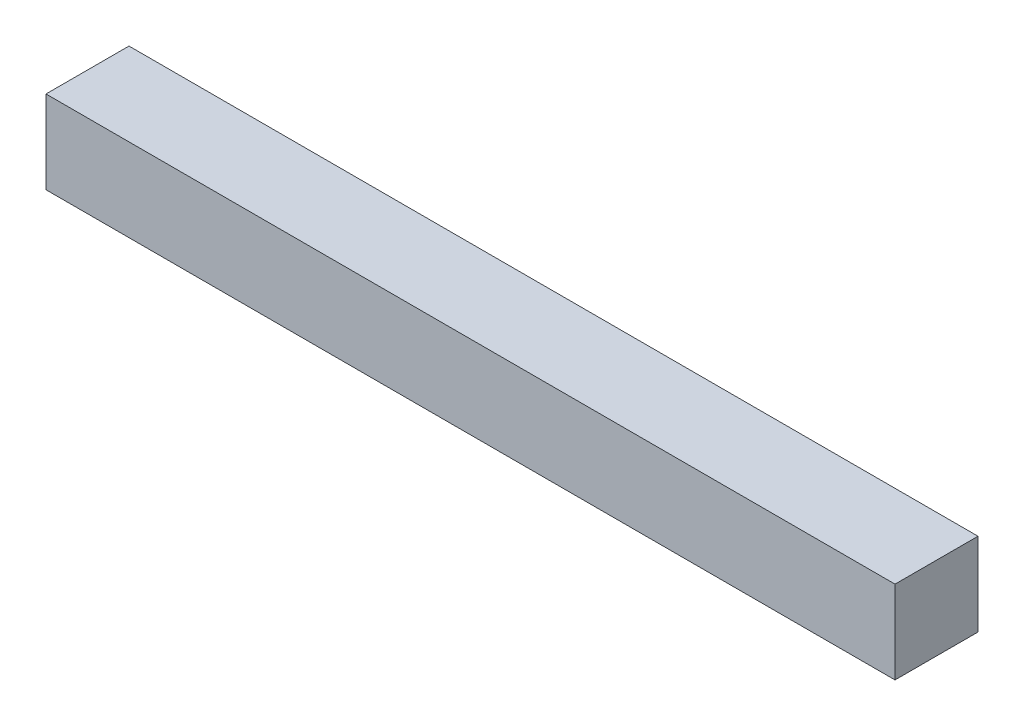
ISO-10303-21;
HEADER;
FILE_DESCRIPTION(('STEP AP214'),'2;1');
FILE_NAME('part.step','',(''),(''),'','','');
FILE_SCHEMA(('AUTOMOTIVE_DESIGN { 1 0 10303 214 1 1 1 1 }'));
ENDSEC;
DATA;
#1=APPLICATION_CONTEXT('core data for automotive mechanical design processes');
#2=APPLICATION_PROTOCOL_DEFINITION('international standard','automotive_design',2000,#1);
#3=PRODUCT_CONTEXT('',#1,'mechanical');
#4=PRODUCT('Part','Part','',(#3));
#5=PRODUCT_RELATED_PRODUCT_CATEGORY('part','',(#4));
#6=PRODUCT_DEFINITION_FORMATION('','',#4);
#7=PRODUCT_DEFINITION_CONTEXT('part definition',#1,'design');
#8=PRODUCT_DEFINITION('design','',#6,#7);
#9=PRODUCT_DEFINITION_SHAPE('','',#8);
#10=(LENGTH_UNIT() NAMED_UNIT(*) SI_UNIT(.MILLI.,.METRE.));
#11=(NAMED_UNIT(*) PLANE_ANGLE_UNIT() SI_UNIT($,.RADIAN.));
#12=(NAMED_UNIT(*) SI_UNIT($,.STERADIAN.) SOLID_ANGLE_UNIT());
#13=UNCERTAINTY_MEASURE_WITH_UNIT(LENGTH_MEASURE(1.E-05),#10,'distance_accuracy_value','');
#14=(GEOMETRIC_REPRESENTATION_CONTEXT(3) GLOBAL_UNCERTAINTY_ASSIGNED_CONTEXT((#13)) GLOBAL_UNIT_ASSIGNED_CONTEXT((#10,
#11,#12)) REPRESENTATION_CONTEXT('',''));
#15=CARTESIAN_POINT('',(0.,0.,0.));
#16=DIRECTION('',(0.,0.,1.));
#17=DIRECTION('',(1.,0.,0.));
#18=AXIS2_PLACEMENT_3D('',#15,#16,#17);
#19=CARTESIAN_POINT('',(-70.6068511796734,40.1724137931035,13.));
#20=DIRECTION('',(1.,0.,0.));
#21=DIRECTION('',(0.,0.,-1.));
#22=AXIS2_PLACEMENT_3D('',#19,#20,#21);
#23=PLANE('',#22);
#24=DIRECTION('',(0.,-1.,0.));
#25=VECTOR('',#24,1.);
#26=CARTESIAN_POINT('',(-70.6068511796734,40.1724137931035,0.));
#27=LINE('',#26,#25);
#28=CARTESIAN_POINT('',(-70.6068511796734,40.1724137931035,0.));
#29=VERTEX_POINT('',#28);
#30=CARTESIAN_POINT('',(-70.6068511796734,27.1724137931035,0.));
#31=VERTEX_POINT('',#30);
#32=EDGE_CURVE('E96',#29,#31,#27,.T.);
#33=ORIENTED_EDGE('',*,*,#32,.T.);
#34=DIRECTION('',(0.,0.,-1.));
#35=VECTOR('',#34,1.);
#36=CARTESIAN_POINT('',(-70.6068511796734,27.1724137931035,13.));
#37=LINE('',#36,#35);
#38=CARTESIAN_POINT('',(-70.6068511796734,27.1724137931035,13.));
#39=VERTEX_POINT('',#38);
#40=EDGE_CURVE('E11',#39,#31,#37,.T.);
#41=ORIENTED_EDGE('',*,*,#40,.F.);
#42=DIRECTION('',(0.,-1.,0.));
#43=VECTOR('',#42,1.);
#44=CARTESIAN_POINT('',(-70.6068511796734,40.1724137931035,13.));
#45=LINE('',#44,#43);
#46=CARTESIAN_POINT('',(-70.6068511796734,40.1724137931035,13.));
#47=VERTEX_POINT('',#46);
#48=EDGE_CURVE('E84',#47,#39,#45,.T.);
#49=ORIENTED_EDGE('',*,*,#48,.F.);
#50=DIRECTION('',(0.,0.,-1.));
#51=VECTOR('',#50,1.);
#52=CARTESIAN_POINT('',(-70.6068511796734,40.1724137931035,13.));
#53=LINE('',#52,#51);
#54=EDGE_CURVE('E92',#47,#29,#53,.T.);
#55=ORIENTED_EDGE('',*,*,#54,.T.);
#56=EDGE_LOOP('',(#33,#41,#49,#55));
#57=FACE_BOUND('',#56,.T.);
#58=ADVANCED_FACE('F33',(#57),#23,.F.);
#59=CARTESIAN_POINT('',(-70.6068511796734,27.1724137931035,13.));
#60=DIRECTION('',(0.,1.,0.));
#61=DIRECTION('',(0.,0.,1.));
#62=AXIS2_PLACEMENT_3D('',#59,#60,#61);
#63=PLANE('',#62);
#64=DIRECTION('',(1.,0.,0.));
#65=VECTOR('',#64,1.);
#66=CARTESIAN_POINT('',(-70.6068511796734,27.1724137931035,0.));
#67=LINE('',#66,#65);
#68=CARTESIAN_POINT('',(62.3931488203266,27.1724137931035,0.));
#69=VERTEX_POINT('',#68);
#70=EDGE_CURVE('E88',#31,#69,#67,.T.);
#71=ORIENTED_EDGE('',*,*,#70,.T.);
#72=DIRECTION('',(0.,0.,-1.));
#73=VECTOR('',#72,1.);
#74=CARTESIAN_POINT('',(62.3931488203266,27.1724137931035,13.));
#75=LINE('',#74,#73);
#76=CARTESIAN_POINT('',(62.3931488203266,27.1724137931035,13.));
#77=VERTEX_POINT('',#76);
#78=EDGE_CURVE('E41',#77,#69,#75,.T.);
#79=ORIENTED_EDGE('',*,*,#78,.F.);
#80=DIRECTION('',(1.,0.,0.));
#81=VECTOR('',#80,1.);
#82=CARTESIAN_POINT('',(-70.6068511796734,27.1724137931035,13.));
#83=LINE('',#82,#81);
#84=EDGE_CURVE('E79',#39,#77,#83,.T.);
#85=ORIENTED_EDGE('',*,*,#84,.F.);
#86=ORIENTED_EDGE('',*,*,#40,.T.);
#87=EDGE_LOOP('',(#71,#79,#85,#86));
#88=FACE_BOUND('',#87,.T.);
#89=ADVANCED_FACE('F87',(#88),#63,.F.);
#90=CARTESIAN_POINT('',(62.3931488203266,40.1724137931035,13.));
#91=DIRECTION('',(-1.,0.,0.));
#92=DIRECTION('',(0.,0.,1.));
#93=AXIS2_PLACEMENT_3D('',#90,#91,#92);
#94=PLANE('',#93);
#95=DIRECTION('',(0.,1.,0.));
#96=VECTOR('',#95,1.);
#97=CARTESIAN_POINT('',(62.3931488203266,40.1724137931035,0.));
#98=LINE('',#97,#96);
#99=CARTESIAN_POINT('',(62.3931488203266,40.1724137931035,0.));
#100=VERTEX_POINT('',#99);
#101=EDGE_CURVE('E66',#69,#100,#98,.T.);
#102=ORIENTED_EDGE('',*,*,#101,.T.);
#103=DIRECTION('',(0.,0.,-1.));
#104=VECTOR('',#103,1.);
#105=CARTESIAN_POINT('',(62.3931488203266,40.1724137931035,13.));
#106=LINE('',#105,#104);
#107=CARTESIAN_POINT('',(62.3931488203266,40.1724137931035,13.));
#108=VERTEX_POINT('',#107);
#109=EDGE_CURVE('E89',#108,#100,#106,.T.);
#110=ORIENTED_EDGE('',*,*,#109,.F.);
#111=DIRECTION('',(0.,1.,0.));
#112=VECTOR('',#111,1.);
#113=CARTESIAN_POINT('',(62.3931488203266,40.1724137931035,13.));
#114=LINE('',#113,#112);
#115=EDGE_CURVE('E82',#77,#108,#114,.T.);
#116=ORIENTED_EDGE('',*,*,#115,.F.);
#117=ORIENTED_EDGE('',*,*,#78,.T.);
#118=EDGE_LOOP('',(#102,#110,#116,#117));
#119=FACE_BOUND('',#118,.T.);
#120=ADVANCED_FACE('F90',(#119),#94,.F.);
#121=CARTESIAN_POINT('',(-70.6068511796734,40.1724137931035,13.));
#122=DIRECTION('',(0.,-1.,0.));
#123=DIRECTION('',(0.,0.,-1.));
#124=AXIS2_PLACEMENT_3D('',#121,#122,#123);
#125=PLANE('',#124);
#126=DIRECTION('',(-1.,0.,0.));
#127=VECTOR('',#126,1.);
#128=CARTESIAN_POINT('',(-70.6068511796734,40.1724137931035,0.));
#129=LINE('',#128,#127);
#130=EDGE_CURVE('E72',#100,#29,#129,.T.);
#131=ORIENTED_EDGE('',*,*,#130,.T.);
#132=ORIENTED_EDGE('',*,*,#54,.F.);
#133=DIRECTION('',(-1.,0.,0.));
#134=VECTOR('',#133,1.);
#135=CARTESIAN_POINT('',(-70.6068511796734,40.1724137931035,13.));
#136=LINE('',#135,#134);
#137=EDGE_CURVE('E49',#108,#47,#136,.T.);
#138=ORIENTED_EDGE('',*,*,#137,.F.);
#139=ORIENTED_EDGE('',*,*,#109,.T.);
#140=EDGE_LOOP('',(#131,#132,#138,#139));
#141=FACE_BOUND('',#140,.T.);
#142=ADVANCED_FACE('F103',(#141),#125,.F.);
#143=CARTESIAN_POINT('',(0.,0.,13.));
#144=DIRECTION('',(0.,0.,1.));
#145=DIRECTION('',(1.,0.,0.));
#146=AXIS2_PLACEMENT_3D('',#143,#144,#145);
#147=PLANE('',#146);
#148=ORIENTED_EDGE('',*,*,#48,.T.);
#149=ORIENTED_EDGE('',*,*,#84,.T.);
#150=ORIENTED_EDGE('',*,*,#115,.T.);
#151=ORIENTED_EDGE('',*,*,#137,.T.);
#152=EDGE_LOOP('',(#148,#149,#150,#151));
#153=FACE_BOUND('',#152,.T.);
#154=ADVANCED_FACE('F80',(#153),#147,.T.);
#155=CARTESIAN_POINT('',(0.,0.,0.));
#156=DIRECTION('',(0.,0.,1.));
#157=DIRECTION('',(1.,0.,0.));
#158=AXIS2_PLACEMENT_3D('',#155,#156,#157);
#159=PLANE('',#158);
#160=ORIENTED_EDGE('',*,*,#32,.F.);
#161=ORIENTED_EDGE('',*,*,#130,.F.);
#162=ORIENTED_EDGE('',*,*,#101,.F.);
#163=ORIENTED_EDGE('',*,*,#70,.F.);
#164=EDGE_LOOP('',(#160,#161,#162,#163));
#165=FACE_BOUND('',#164,.T.);
#166=ADVANCED_FACE('F106',(#165),#159,.F.);
#167=CLOSED_SHELL('',(#58,#89,#120,#142,#154,#166));
#168=MANIFOLD_SOLID_BREP('B2',#167);
#169=ADVANCED_BREP_SHAPE_REPRESENTATION('',(#18,#168),#14);
#170=SHAPE_DEFINITION_REPRESENTATION(#9,#169);
ENDSEC;
END-ISO-10303-21;
